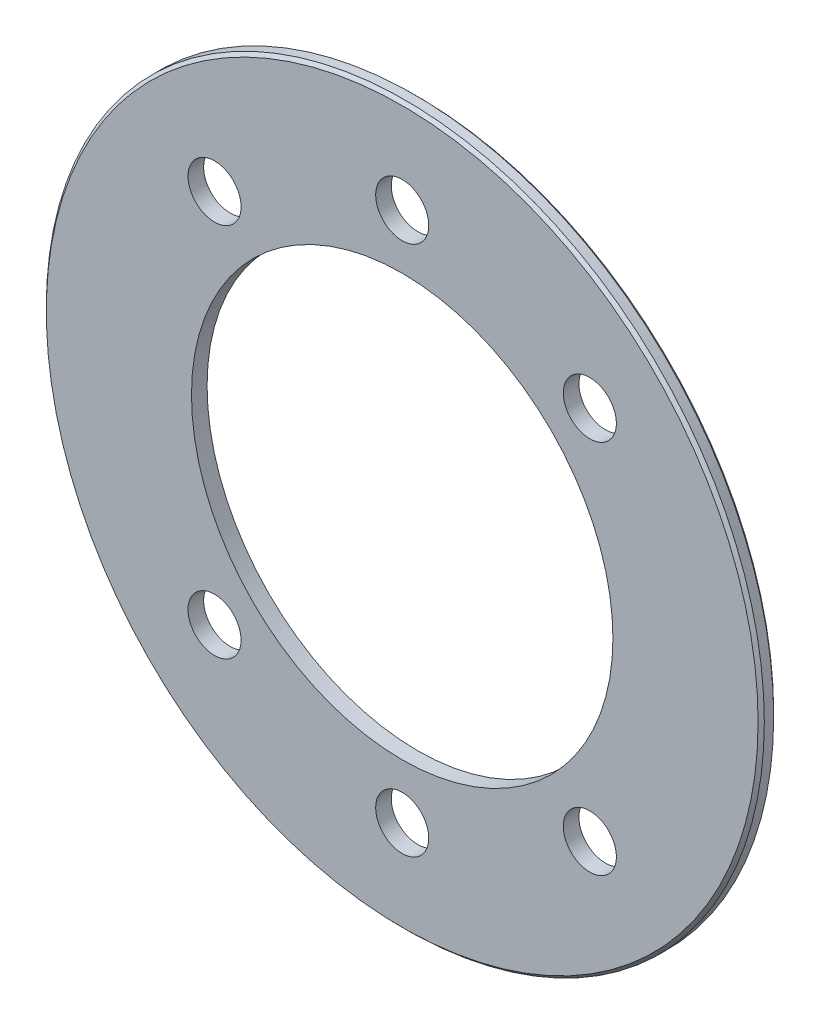
ISO-10303-21;
HEADER;
FILE_DESCRIPTION(('STEP AP214'),'2;1');
FILE_NAME('part.step','',(''),(''),'','','');
FILE_SCHEMA(('AUTOMOTIVE_DESIGN { 1 0 10303 214 1 1 1 1 }'));
ENDSEC;
DATA;
#1=APPLICATION_CONTEXT('core data for automotive mechanical design processes');
#2=APPLICATION_PROTOCOL_DEFINITION('international standard','automotive_design',2000,#1);
#3=PRODUCT_CONTEXT('',#1,'mechanical');
#4=PRODUCT('Part','Part','',(#3));
#5=PRODUCT_RELATED_PRODUCT_CATEGORY('part','',(#4));
#6=PRODUCT_DEFINITION_FORMATION('','',#4);
#7=PRODUCT_DEFINITION_CONTEXT('part definition',#1,'design');
#8=PRODUCT_DEFINITION('design','',#6,#7);
#9=PRODUCT_DEFINITION_SHAPE('','',#8);
#10=(LENGTH_UNIT() NAMED_UNIT(*) SI_UNIT(.MILLI.,.METRE.));
#11=(NAMED_UNIT(*) PLANE_ANGLE_UNIT() SI_UNIT($,.RADIAN.));
#12=(NAMED_UNIT(*) SI_UNIT($,.STERADIAN.) SOLID_ANGLE_UNIT());
#13=UNCERTAINTY_MEASURE_WITH_UNIT(LENGTH_MEASURE(1.E-05),#10,'distance_accuracy_value','');
#14=(GEOMETRIC_REPRESENTATION_CONTEXT(3) GLOBAL_UNCERTAINTY_ASSIGNED_CONTEXT((#13)) GLOBAL_UNIT_ASSIGNED_CONTEXT((#10,
#11,#12)) REPRESENTATION_CONTEXT('',''));
#15=CARTESIAN_POINT('',(0.,0.,0.));
#16=DIRECTION('',(0.,0.,1.));
#17=DIRECTION('',(1.,0.,0.));
#18=AXIS2_PLACEMENT_3D('',#15,#16,#17);
#19=CARTESIAN_POINT('',(0.,0.,1.));
#20=DIRECTION('',(0.,0.,-1.));
#21=DIRECTION('',(-1.,0.,0.));
#22=AXIS2_PLACEMENT_3D('',#19,#20,#21);
#23=CYLINDRICAL_SURFACE('',#22,23.);
#24=CARTESIAN_POINT('',(0.,0.,0.8));
#25=DIRECTION('',(0.,0.,1.));
#26=DIRECTION('',(1.,0.,0.));
#27=AXIS2_PLACEMENT_3D('',#24,#25,#26);
#28=CIRCLE('',#27,23.);
#29=CARTESIAN_POINT('',(23.,0.,0.8));
#30=VERTEX_POINT('',#29);
#31=EDGE_CURVE('E10',#30,#30,#28,.F.);
#32=ORIENTED_EDGE('',*,*,#31,.T.);
#33=EDGE_LOOP('',(#32));
#34=FACE_BOUND('',#33,.T.);
#35=CARTESIAN_POINT('',(0.,0.,0.2));
#36=DIRECTION('',(0.,0.,1.));
#37=DIRECTION('',(1.,0.,0.));
#38=AXIS2_PLACEMENT_3D('',#35,#36,#37);
#39=CIRCLE('',#38,23.);
#40=CARTESIAN_POINT('',(23.,0.,0.2));
#41=VERTEX_POINT('',#40);
#42=EDGE_CURVE('E30',#41,#41,#39,.T.);
#43=ORIENTED_EDGE('',*,*,#42,.T.);
#44=EDGE_LOOP('',(#43));
#45=FACE_BOUND('',#44,.T.);
#46=ADVANCED_FACE('F15',(#34,#45),#23,.T.);
#47=CARTESIAN_POINT('',(0.,0.,1.));
#48=DIRECTION('',(0.,0.,-1.));
#49=DIRECTION('',(-1.,0.,0.));
#50=AXIS2_PLACEMENT_3D('',#47,#48,#49);
#51=CYLINDRICAL_SURFACE('',#50,13.5);
#52=CARTESIAN_POINT('',(0.,0.,1.));
#53=DIRECTION('',(0.,0.,1.));
#54=DIRECTION('',(1.,0.,0.));
#55=AXIS2_PLACEMENT_3D('',#52,#53,#54);
#56=CIRCLE('',#55,13.5);
#57=CARTESIAN_POINT('',(13.5,0.,1.));
#58=VERTEX_POINT('',#57);
#59=EDGE_CURVE('E35',#58,#58,#56,.T.);
#60=ORIENTED_EDGE('',*,*,#59,.T.);
#61=EDGE_LOOP('',(#60));
#62=FACE_BOUND('',#61,.T.);
#63=CARTESIAN_POINT('',(0.,0.,0.));
#64=DIRECTION('',(0.,0.,1.));
#65=DIRECTION('',(1.,0.,0.));
#66=AXIS2_PLACEMENT_3D('',#63,#64,#65);
#67=CIRCLE('',#66,13.5);
#68=CARTESIAN_POINT('',(13.5,0.,0.));
#69=VERTEX_POINT('',#68);
#70=EDGE_CURVE('E60',#69,#69,#67,.T.);
#71=ORIENTED_EDGE('',*,*,#70,.F.);
#72=EDGE_LOOP('',(#71));
#73=FACE_BOUND('',#72,.T.);
#74=ADVANCED_FACE('F85',(#62,#73),#51,.F.);
#75=CARTESIAN_POINT('',(0.,0.,1.));
#76=DIRECTION('',(0.,0.,1.));
#77=DIRECTION('',(1.,0.,0.));
#78=AXIS2_PLACEMENT_3D('',#75,#76,#77);
#79=PLANE('',#78);
#80=CARTESIAN_POINT('',(0.,0.,1.));
#81=DIRECTION('',(0.,0.,1.));
#82=DIRECTION('',(1.,0.,0.));
#83=AXIS2_PLACEMENT_3D('',#80,#81,#82);
#84=CIRCLE('',#83,22.8);
#85=CARTESIAN_POINT('',(22.8,0.,1.));
#86=VERTEX_POINT('',#85);
#87=EDGE_CURVE('E22',#86,#86,#84,.T.);
#88=ORIENTED_EDGE('',*,*,#87,.T.);
#89=EDGE_LOOP('',(#88));
#90=FACE_BOUND('',#89,.T.);
#91=CARTESIAN_POINT('',(-12.0208152801713,12.0208152801713,1.));
#92=DIRECTION('',(0.,0.,1.));
#93=DIRECTION('',(-1.,0.,0.));
#94=AXIS2_PLACEMENT_3D('',#91,#92,#93);
#95=CIRCLE('',#94,1.7);
#96=CARTESIAN_POINT('',(-13.7208152801713,12.0208152801713,1.));
#97=VERTEX_POINT('',#96);
#98=EDGE_CURVE('E40',#97,#97,#95,.T.);
#99=ORIENTED_EDGE('',*,*,#98,.F.);
#100=EDGE_LOOP('',(#99));
#101=FACE_BOUND('',#100,.T.);
#102=CARTESIAN_POINT('',(0.,17.,1.));
#103=DIRECTION('',(0.,0.,1.));
#104=DIRECTION('',(-1.,0.,0.));
#105=AXIS2_PLACEMENT_3D('',#102,#103,#104);
#106=CIRCLE('',#105,1.7);
#107=CARTESIAN_POINT('',(-1.70000000000006,17.,1.));
#108=VERTEX_POINT('',#107);
#109=EDGE_CURVE('E39',#108,#108,#106,.T.);
#110=ORIENTED_EDGE('',*,*,#109,.F.);
#111=EDGE_LOOP('',(#110));
#112=FACE_BOUND('',#111,.T.);
#113=CARTESIAN_POINT('',(12.0208152801713,12.0208152801713,1.));
#114=DIRECTION('',(0.,0.,1.));
#115=DIRECTION('',(-1.,0.,0.));
#116=AXIS2_PLACEMENT_3D('',#113,#114,#115);
#117=CIRCLE('',#116,1.7);
#118=CARTESIAN_POINT('',(10.3208152801713,12.0208152801713,1.));
#119=VERTEX_POINT('',#118);
#120=EDGE_CURVE('E44',#119,#119,#117,.T.);
#121=ORIENTED_EDGE('',*,*,#120,.F.);
#122=EDGE_LOOP('',(#121));
#123=FACE_BOUND('',#122,.T.);
#124=CARTESIAN_POINT('',(-12.0208152801713,-12.0208152801713,1.));
#125=DIRECTION('',(0.,0.,-1.));
#126=DIRECTION('',(-1.,0.,0.));
#127=AXIS2_PLACEMENT_3D('',#124,#125,#126);
#128=CIRCLE('',#127,1.7);
#129=CARTESIAN_POINT('',(-13.7208152801713,-12.0208152801713,1.));
#130=VERTEX_POINT('',#129);
#131=EDGE_CURVE('E48',#130,#130,#128,.T.);
#132=ORIENTED_EDGE('',*,*,#131,.T.);
#133=EDGE_LOOP('',(#132));
#134=FACE_BOUND('',#133,.T.);
#135=CARTESIAN_POINT('',(0.,-17.,1.));
#136=DIRECTION('',(0.,0.,-1.));
#137=DIRECTION('',(-1.,0.,0.));
#138=AXIS2_PLACEMENT_3D('',#135,#136,#137);
#139=CIRCLE('',#138,1.7);
#140=CARTESIAN_POINT('',(-1.70000000000006,-17.,1.));
#141=VERTEX_POINT('',#140);
#142=EDGE_CURVE('E52',#141,#141,#139,.T.);
#143=ORIENTED_EDGE('',*,*,#142,.T.);
#144=EDGE_LOOP('',(#143));
#145=FACE_BOUND('',#144,.T.);
#146=CARTESIAN_POINT('',(12.0208152801713,-12.0208152801713,1.));
#147=DIRECTION('',(0.,0.,-1.));
#148=DIRECTION('',(-1.,0.,0.));
#149=AXIS2_PLACEMENT_3D('',#146,#147,#148);
#150=CIRCLE('',#149,1.7);
#151=CARTESIAN_POINT('',(10.3208152801713,-12.0208152801713,1.));
#152=VERTEX_POINT('',#151);
#153=EDGE_CURVE('E56',#152,#152,#150,.T.);
#154=ORIENTED_EDGE('',*,*,#153,.T.);
#155=EDGE_LOOP('',(#154));
#156=FACE_BOUND('',#155,.T.);
#157=ORIENTED_EDGE('',*,*,#59,.F.);
#158=EDGE_LOOP('',(#157));
#159=FACE_BOUND('',#158,.T.);
#160=ADVANCED_FACE('F81',(#90,#101,#112,#123,#134,#145,#156,#159),#79,.T.);
#161=CARTESIAN_POINT('',(0.,0.,0.));
#162=DIRECTION('',(0.,0.,1.));
#163=DIRECTION('',(1.,0.,0.));
#164=AXIS2_PLACEMENT_3D('',#161,#162,#163);
#165=PLANE('',#164);
#166=CARTESIAN_POINT('',(0.,0.,0.));
#167=DIRECTION('',(0.,0.,1.));
#168=DIRECTION('',(1.,0.,0.));
#169=AXIS2_PLACEMENT_3D('',#166,#167,#168);
#170=CIRCLE('',#169,22.8);
#171=CARTESIAN_POINT('',(22.8,0.,0.));
#172=VERTEX_POINT('',#171);
#173=EDGE_CURVE('E26',#172,#172,#170,.F.);
#174=ORIENTED_EDGE('',*,*,#173,.T.);
#175=EDGE_LOOP('',(#174));
#176=FACE_BOUND('',#175,.T.);
#177=CARTESIAN_POINT('',(-12.0208152801713,12.0208152801713,0.));
#178=DIRECTION('',(0.,0.,1.));
#179=DIRECTION('',(1.,0.,0.));
#180=AXIS2_PLACEMENT_3D('',#177,#178,#179);
#181=CIRCLE('',#180,1.7);
#182=CARTESIAN_POINT('',(-10.3208152801713,12.0208152801713,0.));
#183=VERTEX_POINT('',#182);
#184=EDGE_CURVE('E36',#183,#183,#181,.T.);
#185=ORIENTED_EDGE('',*,*,#184,.T.);
#186=EDGE_LOOP('',(#185));
#187=FACE_BOUND('',#186,.T.);
#188=CARTESIAN_POINT('',(0.,17.,0.));
#189=DIRECTION('',(0.,0.,1.));
#190=DIRECTION('',(1.,0.,0.));
#191=AXIS2_PLACEMENT_3D('',#188,#189,#190);
#192=CIRCLE('',#191,1.7);
#193=CARTESIAN_POINT('',(1.69999999999994,17.,0.));
#194=VERTEX_POINT('',#193);
#195=EDGE_CURVE('E41',#194,#194,#192,.T.);
#196=ORIENTED_EDGE('',*,*,#195,.T.);
#197=EDGE_LOOP('',(#196));
#198=FACE_BOUND('',#197,.T.);
#199=CARTESIAN_POINT('',(12.0208152801713,12.0208152801713,0.));
#200=DIRECTION('',(0.,0.,1.));
#201=DIRECTION('',(1.,0.,0.));
#202=AXIS2_PLACEMENT_3D('',#199,#200,#201);
#203=CIRCLE('',#202,1.7);
#204=CARTESIAN_POINT('',(13.7208152801713,12.0208152801713,0.));
#205=VERTEX_POINT('',#204);
#206=EDGE_CURVE('E45',#205,#205,#203,.T.);
#207=ORIENTED_EDGE('',*,*,#206,.T.);
#208=EDGE_LOOP('',(#207));
#209=FACE_BOUND('',#208,.T.);
#210=CARTESIAN_POINT('',(-12.0208152801713,-12.0208152801713,0.));
#211=DIRECTION('',(0.,0.,1.));
#212=DIRECTION('',(1.,0.,0.));
#213=AXIS2_PLACEMENT_3D('',#210,#211,#212);
#214=CIRCLE('',#213,1.7);
#215=CARTESIAN_POINT('',(-10.3208152801713,-12.0208152801713,0.));
#216=VERTEX_POINT('',#215);
#217=EDGE_CURVE('E49',#216,#216,#214,.T.);
#218=ORIENTED_EDGE('',*,*,#217,.T.);
#219=EDGE_LOOP('',(#218));
#220=FACE_BOUND('',#219,.T.);
#221=CARTESIAN_POINT('',(0.,-17.,0.));
#222=DIRECTION('',(0.,0.,1.));
#223=DIRECTION('',(1.,0.,0.));
#224=AXIS2_PLACEMENT_3D('',#221,#222,#223);
#225=CIRCLE('',#224,1.7);
#226=CARTESIAN_POINT('',(1.69999999999994,-17.,0.));
#227=VERTEX_POINT('',#226);
#228=EDGE_CURVE('E53',#227,#227,#225,.T.);
#229=ORIENTED_EDGE('',*,*,#228,.T.);
#230=EDGE_LOOP('',(#229));
#231=FACE_BOUND('',#230,.T.);
#232=CARTESIAN_POINT('',(12.0208152801713,-12.0208152801713,0.));
#233=DIRECTION('',(0.,0.,1.));
#234=DIRECTION('',(1.,0.,0.));
#235=AXIS2_PLACEMENT_3D('',#232,#233,#234);
#236=CIRCLE('',#235,1.7);
#237=CARTESIAN_POINT('',(13.7208152801713,-12.0208152801713,0.));
#238=VERTEX_POINT('',#237);
#239=EDGE_CURVE('E57',#238,#238,#236,.T.);
#240=ORIENTED_EDGE('',*,*,#239,.T.);
#241=EDGE_LOOP('',(#240));
#242=FACE_BOUND('',#241,.T.);
#243=ORIENTED_EDGE('',*,*,#70,.T.);
#244=EDGE_LOOP('',(#243));
#245=FACE_BOUND('',#244,.T.);
#246=ADVANCED_FACE('F84',(#176,#187,#198,#209,#220,#231,#242,#245),#165,.F.);
#247=CARTESIAN_POINT('',(12.0208152801713,-12.0208152801713,1.));
#248=DIRECTION('',(0.,0.,-1.));
#249=DIRECTION('',(-1.,0.,0.));
#250=AXIS2_PLACEMENT_3D('',#247,#248,#249);
#251=CYLINDRICAL_SURFACE('',#250,1.7);
#252=ORIENTED_EDGE('',*,*,#153,.F.);
#253=EDGE_LOOP('',(#252));
#254=FACE_BOUND('',#253,.T.);
#255=ORIENTED_EDGE('',*,*,#239,.F.);
#256=EDGE_LOOP('',(#255));
#257=FACE_BOUND('',#256,.T.);
#258=ADVANCED_FACE('F105',(#254,#257),#251,.F.);
#259=CARTESIAN_POINT('',(0.,-17.,1.));
#260=DIRECTION('',(0.,0.,-1.));
#261=DIRECTION('',(-1.,0.,0.));
#262=AXIS2_PLACEMENT_3D('',#259,#260,#261);
#263=CYLINDRICAL_SURFACE('',#262,1.7);
#264=ORIENTED_EDGE('',*,*,#142,.F.);
#265=EDGE_LOOP('',(#264));
#266=FACE_BOUND('',#265,.T.);
#267=ORIENTED_EDGE('',*,*,#228,.F.);
#268=EDGE_LOOP('',(#267));
#269=FACE_BOUND('',#268,.T.);
#270=ADVANCED_FACE('F112',(#266,#269),#263,.F.);
#271=CARTESIAN_POINT('',(-12.0208152801713,-12.0208152801713,1.));
#272=DIRECTION('',(0.,0.,-1.));
#273=DIRECTION('',(-1.,0.,0.));
#274=AXIS2_PLACEMENT_3D('',#271,#272,#273);
#275=CYLINDRICAL_SURFACE('',#274,1.7);
#276=ORIENTED_EDGE('',*,*,#131,.F.);
#277=EDGE_LOOP('',(#276));
#278=FACE_BOUND('',#277,.T.);
#279=ORIENTED_EDGE('',*,*,#217,.F.);
#280=EDGE_LOOP('',(#279));
#281=FACE_BOUND('',#280,.T.);
#282=ADVANCED_FACE('F143',(#278,#281),#275,.F.);
#283=CARTESIAN_POINT('',(12.0208152801713,12.0208152801713,1.));
#284=DIRECTION('',(0.,0.,-1.));
#285=DIRECTION('',(-1.,0.,0.));
#286=AXIS2_PLACEMENT_3D('',#283,#284,#285);
#287=CYLINDRICAL_SURFACE('',#286,1.7);
#288=ORIENTED_EDGE('',*,*,#120,.T.);
#289=EDGE_LOOP('',(#288));
#290=FACE_BOUND('',#289,.T.);
#291=ORIENTED_EDGE('',*,*,#206,.F.);
#292=EDGE_LOOP('',(#291));
#293=FACE_BOUND('',#292,.T.);
#294=ADVANCED_FACE('F137',(#290,#293),#287,.F.);
#295=CARTESIAN_POINT('',(0.,17.,1.));
#296=DIRECTION('',(0.,0.,-1.));
#297=DIRECTION('',(-1.,0.,0.));
#298=AXIS2_PLACEMENT_3D('',#295,#296,#297);
#299=CYLINDRICAL_SURFACE('',#298,1.7);
#300=ORIENTED_EDGE('',*,*,#109,.T.);
#301=EDGE_LOOP('',(#300));
#302=FACE_BOUND('',#301,.T.);
#303=ORIENTED_EDGE('',*,*,#195,.F.);
#304=EDGE_LOOP('',(#303));
#305=FACE_BOUND('',#304,.T.);
#306=ADVANCED_FACE('F129',(#302,#305),#299,.F.);
#307=CARTESIAN_POINT('',(-12.0208152801713,12.0208152801713,1.));
#308=DIRECTION('',(0.,0.,-1.));
#309=DIRECTION('',(-1.,0.,0.));
#310=AXIS2_PLACEMENT_3D('',#307,#308,#309);
#311=CYLINDRICAL_SURFACE('',#310,1.7);
#312=ORIENTED_EDGE('',*,*,#98,.T.);
#313=EDGE_LOOP('',(#312));
#314=FACE_BOUND('',#313,.T.);
#315=ORIENTED_EDGE('',*,*,#184,.F.);
#316=EDGE_LOOP('',(#315));
#317=FACE_BOUND('',#316,.T.);
#318=ADVANCED_FACE('F78',(#314,#317),#311,.F.);
#319=CARTESIAN_POINT('',(0.,0.,0.2));
#320=DIRECTION('',(0.,0.,1.));
#321=DIRECTION('',(1.,0.,0.));
#322=AXIS2_PLACEMENT_3D('',#319,#320,#321);
#323=CONICAL_SURFACE('',#322,23.,0.785398163397445);
#324=ORIENTED_EDGE('',*,*,#173,.F.);
#325=EDGE_LOOP('',(#324));
#326=FACE_BOUND('',#325,.T.);
#327=ORIENTED_EDGE('',*,*,#42,.F.);
#328=EDGE_LOOP('',(#327));
#329=FACE_BOUND('',#328,.T.);
#330=ADVANCED_FACE('F121',(#326,#329),#323,.T.);
#331=CARTESIAN_POINT('',(0.,0.,1.));
#332=DIRECTION('',(0.,0.,-1.));
#333=DIRECTION('',(-1.,0.,0.));
#334=AXIS2_PLACEMENT_3D('',#331,#332,#333);
#335=CONICAL_SURFACE('',#334,22.8,0.785398163397445);
#336=ORIENTED_EDGE('',*,*,#31,.F.);
#337=EDGE_LOOP('',(#336));
#338=FACE_BOUND('',#337,.T.);
#339=ORIENTED_EDGE('',*,*,#87,.F.);
#340=EDGE_LOOP('',(#339));
#341=FACE_BOUND('',#340,.T.);
#342=ADVANCED_FACE('F17',(#338,#341),#335,.T.);
#343=CLOSED_SHELL('',(#46,#74,#160,#246,#258,#270,#282,#294,#306,#318,#330,#342));
#344=MANIFOLD_SOLID_BREP('B1',#343);
#345=ADVANCED_BREP_SHAPE_REPRESENTATION('',(#18,#344),#14);
#346=SHAPE_DEFINITION_REPRESENTATION(#9,#345);
ENDSEC;
END-ISO-10303-21;
